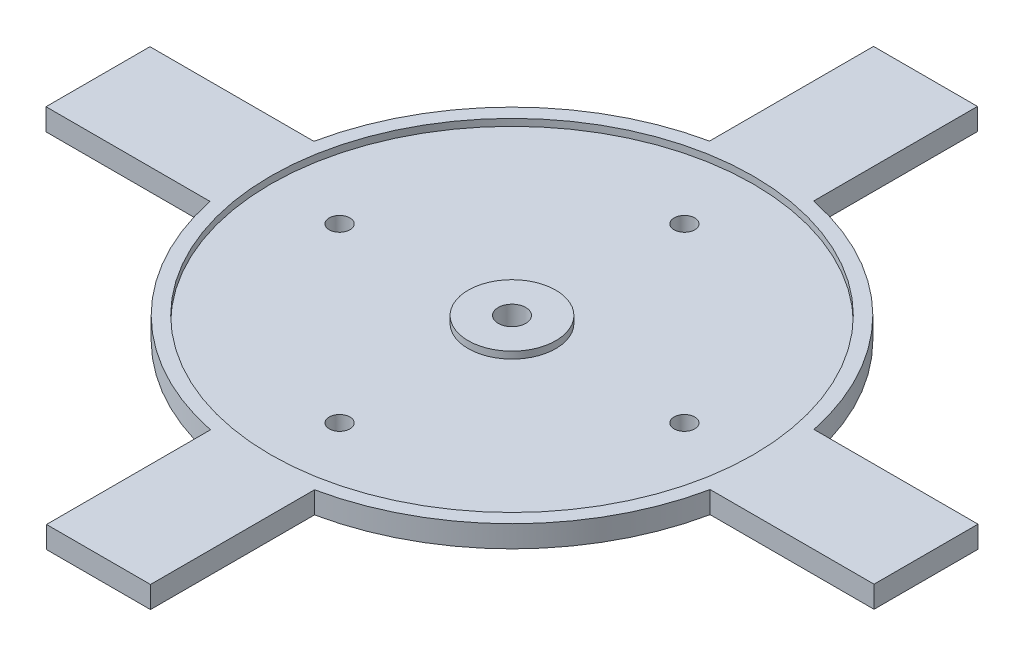
ISO-10303-21;
HEADER;
FILE_DESCRIPTION(('STEP AP214'),'2;1');
FILE_NAME('part.step','',(''),(''),'','','');
FILE_SCHEMA(('AUTOMOTIVE_DESIGN { 1 0 10303 214 1 1 1 1 }'));
ENDSEC;
DATA;
#1=APPLICATION_CONTEXT('core data for automotive mechanical design processes');
#2=APPLICATION_PROTOCOL_DEFINITION('international standard','automotive_design',2000,#1);
#3=PRODUCT_CONTEXT('',#1,'mechanical');
#4=PRODUCT('Part','Part','',(#3));
#5=PRODUCT_RELATED_PRODUCT_CATEGORY('part','',(#4));
#6=PRODUCT_DEFINITION_FORMATION('','',#4);
#7=PRODUCT_DEFINITION_CONTEXT('part definition',#1,'design');
#8=PRODUCT_DEFINITION('design','',#6,#7);
#9=PRODUCT_DEFINITION_SHAPE('','',#8);
#10=(LENGTH_UNIT() NAMED_UNIT(*) SI_UNIT(.MILLI.,.METRE.));
#11=(NAMED_UNIT(*) PLANE_ANGLE_UNIT() SI_UNIT($,.RADIAN.));
#12=(NAMED_UNIT(*) SI_UNIT($,.STERADIAN.) SOLID_ANGLE_UNIT());
#13=UNCERTAINTY_MEASURE_WITH_UNIT(LENGTH_MEASURE(1.E-05),#10,'distance_accuracy_value','');
#14=(GEOMETRIC_REPRESENTATION_CONTEXT(3) GLOBAL_UNCERTAINTY_ASSIGNED_CONTEXT((#13)) GLOBAL_UNIT_ASSIGNED_CONTEXT((#10,
#11,#12)) REPRESENTATION_CONTEXT('',''));
#15=CARTESIAN_POINT('',(0.,0.,0.));
#16=DIRECTION('',(0.,0.,1.));
#17=DIRECTION('',(1.,0.,0.));
#18=AXIS2_PLACEMENT_3D('',#15,#16,#17);
#19=CARTESIAN_POINT('',(0.,3.1581727973184,0.));
#20=DIRECTION('',(0.,-1.,0.));
#21=DIRECTION('',(0.,0.,-1.));
#22=AXIS2_PLACEMENT_3D('',#19,#20,#21);
#23=CYLINDRICAL_SURFACE('',#22,37.);
#24=DIRECTION('',(0.,-1.,0.));
#25=VECTOR('',#24,1.);
#26=CARTESIAN_POINT('',(36.2318920289846,3.1581727973184,7.50000000000038));
#27=LINE('',#26,#25);
#28=CARTESIAN_POINT('',(36.2318920289846,3.1581727973184,7.50000000000038));
#29=VERTEX_POINT('',#28);
#30=CARTESIAN_POINT('',(36.2318920289846,0.,7.50000000000038));
#31=VERTEX_POINT('',#30);
#32=EDGE_CURVE('E298',#29,#31,#27,.T.);
#33=ORIENTED_EDGE('',*,*,#32,.F.);
#34=CARTESIAN_POINT('',(0.,3.1581727973184,0.));
#35=DIRECTION('',(0.,1.,0.));
#36=DIRECTION('',(0.,0.,1.));
#37=AXIS2_PLACEMENT_3D('',#34,#35,#36);
#38=CIRCLE('',#37,37.);
#39=CARTESIAN_POINT('',(7.57567338664189,3.1581727973184,36.2161451943595));
#40=VERTEX_POINT('',#39);
#41=EDGE_CURVE('E12',#40,#29,#38,.T.);
#42=ORIENTED_EDGE('',*,*,#41,.F.);
#43=DIRECTION('',(0.,-1.,0.));
#44=VECTOR('',#43,1.);
#45=CARTESIAN_POINT('',(7.57567338664189,3.1581727973184,36.2161451943595));
#46=LINE('',#45,#44);
#47=CARTESIAN_POINT('',(7.57567338664189,0.,36.2161451943595));
#48=VERTEX_POINT('',#47);
#49=EDGE_CURVE('E323',#40,#48,#46,.T.);
#50=ORIENTED_EDGE('',*,*,#49,.T.);
#51=CARTESIAN_POINT('',(0.,0.,0.));
#52=DIRECTION('',(0.,1.,0.));
#53=DIRECTION('',(0.,0.,1.));
#54=AXIS2_PLACEMENT_3D('',#51,#52,#53);
#55=CIRCLE('',#54,37.);
#56=EDGE_CURVE('E336',#48,#31,#55,.T.);
#57=ORIENTED_EDGE('',*,*,#56,.T.);
#58=EDGE_LOOP('',(#33,#42,#50,#57));
#59=FACE_BOUND('',#58,.T.);
#60=ADVANCED_FACE('F92',(#59),#23,.T.);
#61=CARTESIAN_POINT('',(36.2161451943595,3.1581727973184,-7.57567338664151));
#62=VERTEX_POINT('',#61);
#63=CARTESIAN_POINT('',(7.5,3.1581727973184,-36.2318920289846));
#64=VERTEX_POINT('',#63);
#65=EDGE_CURVE('E101',#62,#64,#38,.T.);
#66=ORIENTED_EDGE('',*,*,#65,.F.);
#67=DIRECTION('',(0.,-1.,0.));
#68=VECTOR('',#67,1.);
#69=CARTESIAN_POINT('',(36.2161451943595,3.1581727973184,-7.57567338664151));
#70=LINE('',#69,#68);
#71=CARTESIAN_POINT('',(36.2161451943595,0.,-7.57567338664151));
#72=VERTEX_POINT('',#71);
#73=EDGE_CURVE('E228',#62,#72,#70,.T.);
#74=ORIENTED_EDGE('',*,*,#73,.T.);
#75=CARTESIAN_POINT('',(7.5,0.,-36.2318920289846));
#76=VERTEX_POINT('',#75);
#77=EDGE_CURVE('E338',#72,#76,#55,.T.);
#78=ORIENTED_EDGE('',*,*,#77,.T.);
#79=DIRECTION('',(0.,-1.,0.));
#80=VECTOR('',#79,1.);
#81=CARTESIAN_POINT('',(7.5,3.1581727973184,-36.2318920289846));
#82=LINE('',#81,#80);
#83=EDGE_CURVE('E295',#64,#76,#82,.T.);
#84=ORIENTED_EDGE('',*,*,#83,.F.);
#85=EDGE_LOOP('',(#66,#74,#78,#84));
#86=FACE_BOUND('',#85,.T.);
#87=ADVANCED_FACE('F395',(#86),#23,.T.);
#88=CARTESIAN_POINT('',(-7.57567338664189,3.1581727973184,-36.2161451943595));
#89=VERTEX_POINT('',#88);
#90=CARTESIAN_POINT('',(-36.2318920289846,3.1581727973184,-7.50000000000013));
#91=VERTEX_POINT('',#90);
#92=EDGE_CURVE('E411',#89,#91,#38,.T.);
#93=ORIENTED_EDGE('',*,*,#92,.F.);
#94=DIRECTION('',(0.,-1.,0.));
#95=VECTOR('',#94,1.);
#96=CARTESIAN_POINT('',(-7.57567338664189,3.1581727973184,-36.2161451943595));
#97=LINE('',#96,#95);
#98=CARTESIAN_POINT('',(-7.57567338664189,0.,-36.2161451943595));
#99=VERTEX_POINT('',#98);
#100=EDGE_CURVE('E304',#89,#99,#97,.T.);
#101=ORIENTED_EDGE('',*,*,#100,.T.);
#102=CARTESIAN_POINT('',(-36.2318920289846,0.,-7.50000000000013));
#103=VERTEX_POINT('',#102);
#104=EDGE_CURVE('E424',#99,#103,#55,.T.);
#105=ORIENTED_EDGE('',*,*,#104,.T.);
#106=DIRECTION('',(0.,-1.,0.));
#107=VECTOR('',#106,1.);
#108=CARTESIAN_POINT('',(-36.2318920289846,3.1581727973184,-7.50000000000013));
#109=LINE('',#108,#107);
#110=EDGE_CURVE('E117',#91,#103,#109,.T.);
#111=ORIENTED_EDGE('',*,*,#110,.F.);
#112=EDGE_LOOP('',(#93,#101,#105,#111));
#113=FACE_BOUND('',#112,.T.);
#114=ADVANCED_FACE('F400',(#113),#23,.T.);
#115=CARTESIAN_POINT('',(-36.2161451943595,3.1581727973184,7.57567338664176));
#116=VERTEX_POINT('',#115);
#117=CARTESIAN_POINT('',(-7.5,3.1581727973184,36.2318920289846));
#118=VERTEX_POINT('',#117);
#119=EDGE_CURVE('E103',#116,#118,#38,.T.);
#120=ORIENTED_EDGE('',*,*,#119,.F.);
#121=DIRECTION('',(0.,-1.,0.));
#122=VECTOR('',#121,1.);
#123=CARTESIAN_POINT('',(-36.2161451943595,3.1581727973184,7.57567338664176));
#124=LINE('',#123,#122);
#125=CARTESIAN_POINT('',(-36.2161451943595,0.,7.57567338664176));
#126=VERTEX_POINT('',#125);
#127=EDGE_CURVE('E302',#116,#126,#124,.T.);
#128=ORIENTED_EDGE('',*,*,#127,.T.);
#129=CARTESIAN_POINT('',(-7.5,0.,36.2318920289846));
#130=VERTEX_POINT('',#129);
#131=EDGE_CURVE('E334',#126,#130,#55,.T.);
#132=ORIENTED_EDGE('',*,*,#131,.T.);
#133=DIRECTION('',(0.,-1.,0.));
#134=VECTOR('',#133,1.);
#135=CARTESIAN_POINT('',(-7.5,3.1581727973184,36.2318920289846));
#136=LINE('',#135,#134);
#137=EDGE_CURVE('E332',#118,#130,#136,.T.);
#138=ORIENTED_EDGE('',*,*,#137,.F.);
#139=EDGE_LOOP('',(#120,#128,#132,#138));
#140=FACE_BOUND('',#139,.T.);
#141=ADVANCED_FACE('F94',(#140),#23,.T.);
#142=CARTESIAN_POINT('',(0.,3.1581727973184,0.));
#143=DIRECTION('',(0.,1.,0.));
#144=DIRECTION('',(0.,0.,1.));
#145=AXIS2_PLACEMENT_3D('',#142,#143,#144);
#146=PLANE('',#145);
#147=CARTESIAN_POINT('',(0.,3.1581727973184,0.));
#148=DIRECTION('',(0.,1.,0.));
#149=DIRECTION('',(0.,0.,1.));
#150=AXIS2_PLACEMENT_3D('',#147,#148,#149);
#151=CIRCLE('',#150,35.);
#152=CARTESIAN_POINT('',(0.,3.1581727973184,35.));
#153=VERTEX_POINT('',#152);
#154=EDGE_CURVE('E237',#153,#153,#151,.T.);
#155=ORIENTED_EDGE('',*,*,#154,.F.);
#156=EDGE_LOOP('',(#155));
#157=FACE_BOUND('',#156,.T.);
#158=ORIENTED_EDGE('',*,*,#65,.T.);
#159=DIRECTION('',(0.,0.,1.));
#160=VECTOR('',#159,1.);
#161=CARTESIAN_POINT('',(7.5,3.1581727973184,-60.));
#162=LINE('',#161,#160);
#163=CARTESIAN_POINT('',(7.5,3.1581727973184,-60.));
#164=VERTEX_POINT('',#163);
#165=EDGE_CURVE('E268',#164,#64,#162,.T.);
#166=ORIENTED_EDGE('',*,*,#165,.F.);
#167=DIRECTION('',(1.,0.,0.));
#168=VECTOR('',#167,1.);
#169=CARTESIAN_POINT('',(0.,3.1581727973184,-60.));
#170=LINE('',#169,#168);
#171=CARTESIAN_POINT('',(-7.57567338664189,3.1581727973184,-60.));
#172=VERTEX_POINT('',#171);
#173=EDGE_CURVE('E255',#172,#164,#170,.T.);
#174=ORIENTED_EDGE('',*,*,#173,.F.);
#175=DIRECTION('',(0.,0.,1.));
#176=VECTOR('',#175,1.);
#177=CARTESIAN_POINT('',(-7.57567338664189,3.1581727973184,-60.));
#178=LINE('',#177,#176);
#179=EDGE_CURVE('E251',#172,#89,#178,.T.);
#180=ORIENTED_EDGE('',*,*,#179,.T.);
#181=ORIENTED_EDGE('',*,*,#92,.T.);
#182=DIRECTION('',(1.,0.,0.));
#183=VECTOR('',#182,1.);
#184=CARTESIAN_POINT('',(-60.,3.1581727973184,-7.50000000000021));
#185=LINE('',#184,#183);
#186=CARTESIAN_POINT('',(-60.,3.1581727973184,-7.50000000000021));
#187=VERTEX_POINT('',#186);
#188=EDGE_CURVE('E291',#187,#91,#185,.T.);
#189=ORIENTED_EDGE('',*,*,#188,.F.);
#190=DIRECTION('',(0.,0.,-1.));
#191=VECTOR('',#190,1.);
#192=CARTESIAN_POINT('',(-60.,3.1581727973184,-2.09488880330588E-13));
#193=LINE('',#192,#191);
#194=CARTESIAN_POINT('',(-60.,3.1581727973184,7.57567338664168));
#195=VERTEX_POINT('',#194);
#196=EDGE_CURVE('E278',#195,#187,#193,.T.);
#197=ORIENTED_EDGE('',*,*,#196,.F.);
#198=DIRECTION('',(1.,0.,0.));
#199=VECTOR('',#198,1.);
#200=CARTESIAN_POINT('',(-60.,3.1581727973184,7.57567338664168));
#201=LINE('',#200,#199);
#202=EDGE_CURVE('E274',#195,#116,#201,.T.);
#203=ORIENTED_EDGE('',*,*,#202,.T.);
#204=ORIENTED_EDGE('',*,*,#119,.T.);
#205=DIRECTION('',(0.,0.,-1.));
#206=VECTOR('',#205,1.);
#207=CARTESIAN_POINT('',(-7.5,3.1581727973184,60.));
#208=LINE('',#207,#206);
#209=CARTESIAN_POINT('',(-7.5,3.1581727973184,60.));
#210=VERTEX_POINT('',#209);
#211=EDGE_CURVE('E320',#210,#118,#208,.T.);
#212=ORIENTED_EDGE('',*,*,#211,.F.);
#213=DIRECTION('',(-1.,0.,0.));
#214=VECTOR('',#213,1.);
#215=CARTESIAN_POINT('',(0.,3.1581727973184,60.));
#216=LINE('',#215,#214);
#217=CARTESIAN_POINT('',(7.57567338664189,3.1581727973184,60.));
#218=VERTEX_POINT('',#217);
#219=EDGE_CURVE('E308',#218,#210,#216,.T.);
#220=ORIENTED_EDGE('',*,*,#219,.F.);
#221=DIRECTION('',(0.,0.,-1.));
#222=VECTOR('',#221,1.);
#223=CARTESIAN_POINT('',(7.57567338664189,3.1581727973184,60.));
#224=LINE('',#223,#222);
#225=EDGE_CURVE('E326',#218,#40,#224,.T.);
#226=ORIENTED_EDGE('',*,*,#225,.T.);
#227=ORIENTED_EDGE('',*,*,#41,.T.);
#228=DIRECTION('',(-1.,0.,0.));
#229=VECTOR('',#228,1.);
#230=CARTESIAN_POINT('',(59.9999999999999,3.1581727973184,7.50000000000063));
#231=LINE('',#230,#229);
#232=CARTESIAN_POINT('',(59.9999999999999,3.1581727973184,7.50000000000063));
#233=VERTEX_POINT('',#232);
#234=EDGE_CURVE('E215',#233,#29,#231,.T.);
#235=ORIENTED_EDGE('',*,*,#234,.F.);
#236=DIRECTION('',(0.,0.,1.));
#237=VECTOR('',#236,1.);
#238=CARTESIAN_POINT('',(60.,3.1581727973184,6.28466640991764E-13));
#239=LINE('',#238,#237);
#240=CARTESIAN_POINT('',(60.0000000000001,3.1581727973184,-7.57567338664126));
#241=VERTEX_POINT('',#240);
#242=EDGE_CURVE('E209',#241,#233,#239,.T.);
#243=ORIENTED_EDGE('',*,*,#242,.F.);
#244=DIRECTION('',(-1.,0.,0.));
#245=VECTOR('',#244,1.);
#246=CARTESIAN_POINT('',(60.0000000000001,3.1581727973184,-7.57567338664126));
#247=LINE('',#246,#245);
#248=EDGE_CURVE('E213',#241,#62,#247,.T.);
#249=ORIENTED_EDGE('',*,*,#248,.T.);
#250=EDGE_LOOP('',(#158,#166,#174,#180,#181,#189,#197,#203,#204,#212,#220,#226,#227,#235,#243,#249));
#251=FACE_BOUND('',#250,.T.);
#252=ADVANCED_FACE('F212',(#157,#251),#146,.T.);
#253=CARTESIAN_POINT('',(0.,0.,0.));
#254=DIRECTION('',(0.,1.,0.));
#255=DIRECTION('',(0.,0.,1.));
#256=AXIS2_PLACEMENT_3D('',#253,#254,#255);
#257=PLANE('',#256);
#258=CARTESIAN_POINT('',(25.,0.,0.));
#259=DIRECTION('',(0.,1.,0.));
#260=DIRECTION('',(0.,0.,1.));
#261=AXIS2_PLACEMENT_3D('',#258,#259,#260);
#262=CIRCLE('',#261,1.5);
#263=CARTESIAN_POINT('',(25.,0.,1.50000000000009));
#264=VERTEX_POINT('',#263);
#265=EDGE_CURVE('E343',#264,#264,#262,.T.);
#266=ORIENTED_EDGE('',*,*,#265,.T.);
#267=EDGE_LOOP('',(#266));
#268=FACE_BOUND('',#267,.T.);
#269=CARTESIAN_POINT('',(0.,0.,25.));
#270=DIRECTION('',(0.,1.,0.));
#271=DIRECTION('',(0.,0.,1.));
#272=AXIS2_PLACEMENT_3D('',#269,#270,#271);
#273=CIRCLE('',#272,1.5);
#274=CARTESIAN_POINT('',(0.,0.,26.5));
#275=VERTEX_POINT('',#274);
#276=EDGE_CURVE('E349',#275,#275,#273,.T.);
#277=ORIENTED_EDGE('',*,*,#276,.T.);
#278=EDGE_LOOP('',(#277));
#279=FACE_BOUND('',#278,.T.);
#280=CARTESIAN_POINT('',(-25.,0.,-2.61861100413235E-13));
#281=DIRECTION('',(0.,1.,0.));
#282=DIRECTION('',(0.,0.,1.));
#283=AXIS2_PLACEMENT_3D('',#280,#281,#282);
#284=CIRCLE('',#283,1.5);
#285=CARTESIAN_POINT('',(-25.,0.,1.49999999999974));
#286=VERTEX_POINT('',#285);
#287=EDGE_CURVE('E346',#286,#286,#284,.T.);
#288=ORIENTED_EDGE('',*,*,#287,.T.);
#289=EDGE_LOOP('',(#288));
#290=FACE_BOUND('',#289,.T.);
#291=CARTESIAN_POINT('',(0.,0.,-25.));
#292=DIRECTION('',(0.,1.,0.));
#293=DIRECTION('',(0.,0.,1.));
#294=AXIS2_PLACEMENT_3D('',#291,#292,#293);
#295=CIRCLE('',#294,1.5);
#296=CARTESIAN_POINT('',(0.,0.,-23.5));
#297=VERTEX_POINT('',#296);
#298=EDGE_CURVE('E342',#297,#297,#295,.T.);
#299=ORIENTED_EDGE('',*,*,#298,.T.);
#300=EDGE_LOOP('',(#299));
#301=FACE_BOUND('',#300,.T.);
#302=CARTESIAN_POINT('',(0.,0.,0.));
#303=DIRECTION('',(0.,1.,0.));
#304=DIRECTION('',(0.,0.,1.));
#305=AXIS2_PLACEMENT_3D('',#302,#303,#304);
#306=CIRCLE('',#305,2.);
#307=CARTESIAN_POINT('',(0.,0.,2.));
#308=VERTEX_POINT('',#307);
#309=EDGE_CURVE('E366',#308,#308,#306,.T.);
#310=ORIENTED_EDGE('',*,*,#309,.T.);
#311=EDGE_LOOP('',(#310));
#312=FACE_BOUND('',#311,.T.);
#313=ORIENTED_EDGE('',*,*,#104,.F.);
#314=DIRECTION('',(0.,0.,1.));
#315=VECTOR('',#314,1.);
#316=CARTESIAN_POINT('',(-7.57567338664189,0.,-60.));
#317=LINE('',#316,#315);
#318=CARTESIAN_POINT('',(-7.57567338664189,0.,-60.));
#319=VERTEX_POINT('',#318);
#320=EDGE_CURVE('E252',#319,#99,#317,.T.);
#321=ORIENTED_EDGE('',*,*,#320,.F.);
#322=DIRECTION('',(1.,0.,0.));
#323=VECTOR('',#322,1.);
#324=CARTESIAN_POINT('',(0.,0.,-60.));
#325=LINE('',#324,#323);
#326=CARTESIAN_POINT('',(7.5,0.,-60.));
#327=VERTEX_POINT('',#326);
#328=EDGE_CURVE('E262',#319,#327,#325,.T.);
#329=ORIENTED_EDGE('',*,*,#328,.T.);
#330=DIRECTION('',(0.,0.,1.));
#331=VECTOR('',#330,1.);
#332=CARTESIAN_POINT('',(7.5,0.,-60.));
#333=LINE('',#332,#331);
#334=EDGE_CURVE('E265',#327,#76,#333,.T.);
#335=ORIENTED_EDGE('',*,*,#334,.T.);
#336=ORIENTED_EDGE('',*,*,#77,.F.);
#337=DIRECTION('',(-1.,0.,0.));
#338=VECTOR('',#337,1.);
#339=CARTESIAN_POINT('',(60.0000000000001,0.,-7.57567338664126));
#340=LINE('',#339,#338);
#341=CARTESIAN_POINT('',(60.0000000000001,0.,-7.57567338664126));
#342=VERTEX_POINT('',#341);
#343=EDGE_CURVE('E219',#342,#72,#340,.T.);
#344=ORIENTED_EDGE('',*,*,#343,.F.);
#345=DIRECTION('',(0.,0.,1.));
#346=VECTOR('',#345,1.);
#347=CARTESIAN_POINT('',(60.,0.,6.28466640991764E-13));
#348=LINE('',#347,#346);
#349=CARTESIAN_POINT('',(59.9999999999999,0.,7.50000000000063));
#350=VERTEX_POINT('',#349);
#351=EDGE_CURVE('E232',#342,#350,#348,.T.);
#352=ORIENTED_EDGE('',*,*,#351,.T.);
#353=DIRECTION('',(-1.,0.,0.));
#354=VECTOR('',#353,1.);
#355=CARTESIAN_POINT('',(59.9999999999999,0.,7.50000000000063));
#356=LINE('',#355,#354);
#357=EDGE_CURVE('E244',#350,#31,#356,.T.);
#358=ORIENTED_EDGE('',*,*,#357,.T.);
#359=ORIENTED_EDGE('',*,*,#56,.F.);
#360=DIRECTION('',(0.,0.,-1.));
#361=VECTOR('',#360,1.);
#362=CARTESIAN_POINT('',(7.57567338664189,0.,60.));
#363=LINE('',#362,#361);
#364=CARTESIAN_POINT('',(7.57567338664189,0.,60.));
#365=VERTEX_POINT('',#364);
#366=EDGE_CURVE('E312',#365,#48,#363,.T.);
#367=ORIENTED_EDGE('',*,*,#366,.F.);
#368=DIRECTION('',(-1.,0.,0.));
#369=VECTOR('',#368,1.);
#370=CARTESIAN_POINT('',(0.,0.,60.));
#371=LINE('',#370,#369);
#372=CARTESIAN_POINT('',(-7.5,0.,60.));
#373=VERTEX_POINT('',#372);
#374=EDGE_CURVE('E314',#365,#373,#371,.T.);
#375=ORIENTED_EDGE('',*,*,#374,.T.);
#376=DIRECTION('',(0.,0.,-1.));
#377=VECTOR('',#376,1.);
#378=CARTESIAN_POINT('',(-7.5,0.,60.));
#379=LINE('',#378,#377);
#380=EDGE_CURVE('E317',#373,#130,#379,.T.);
#381=ORIENTED_EDGE('',*,*,#380,.T.);
#382=ORIENTED_EDGE('',*,*,#131,.F.);
#383=DIRECTION('',(1.,0.,0.));
#384=VECTOR('',#383,1.);
#385=CARTESIAN_POINT('',(-60.,0.,7.57567338664168));
#386=LINE('',#385,#384);
#387=CARTESIAN_POINT('',(-60.,0.,7.57567338664168));
#388=VERTEX_POINT('',#387);
#389=EDGE_CURVE('E275',#388,#126,#386,.T.);
#390=ORIENTED_EDGE('',*,*,#389,.F.);
#391=DIRECTION('',(0.,0.,-1.));
#392=VECTOR('',#391,1.);
#393=CARTESIAN_POINT('',(-60.,0.,-2.09488880330588E-13));
#394=LINE('',#393,#392);
#395=CARTESIAN_POINT('',(-60.,0.,-7.50000000000021));
#396=VERTEX_POINT('',#395);
#397=EDGE_CURVE('E285',#388,#396,#394,.T.);
#398=ORIENTED_EDGE('',*,*,#397,.T.);
#399=DIRECTION('',(1.,0.,0.));
#400=VECTOR('',#399,1.);
#401=CARTESIAN_POINT('',(-60.,0.,-7.50000000000021));
#402=LINE('',#401,#400);
#403=EDGE_CURVE('E288',#396,#103,#402,.T.);
#404=ORIENTED_EDGE('',*,*,#403,.T.);
#405=EDGE_LOOP('',(#313,#321,#329,#335,#336,#344,#352,#358,#359,#367,#375,#381,#382,#390,#398,#404));
#406=FACE_BOUND('',#405,.T.);
#407=ADVANCED_FACE('F407',(#268,#279,#290,#301,#312,#406),#257,.F.);
#408=CARTESIAN_POINT('',(-7.5,3.1581727973184,60.));
#409=DIRECTION('',(1.,0.,0.));
#410=DIRECTION('',(0.,0.,-1.));
#411=AXIS2_PLACEMENT_3D('',#408,#409,#410);
#412=PLANE('',#411);
#413=ORIENTED_EDGE('',*,*,#211,.T.);
#414=ORIENTED_EDGE('',*,*,#137,.T.);
#415=ORIENTED_EDGE('',*,*,#380,.F.);
#416=DIRECTION('',(0.,-1.,0.));
#417=VECTOR('',#416,1.);
#418=CARTESIAN_POINT('',(-7.5,3.1581727973184,60.));
#419=LINE('',#418,#417);
#420=EDGE_CURVE('E311',#210,#373,#419,.T.);
#421=ORIENTED_EDGE('',*,*,#420,.F.);
#422=EDGE_LOOP('',(#413,#414,#415,#421));
#423=FACE_BOUND('',#422,.T.);
#424=ADVANCED_FACE('F429',(#423),#412,.F.);
#425=CARTESIAN_POINT('',(7.57567338664189,3.1581727973184,60.));
#426=DIRECTION('',(1.,0.,0.));
#427=DIRECTION('',(0.,0.,-1.));
#428=AXIS2_PLACEMENT_3D('',#425,#426,#427);
#429=PLANE('',#428);
#430=ORIENTED_EDGE('',*,*,#49,.F.);
#431=ORIENTED_EDGE('',*,*,#225,.F.);
#432=DIRECTION('',(0.,-1.,0.));
#433=VECTOR('',#432,1.);
#434=CARTESIAN_POINT('',(7.57567338664189,3.1581727973184,60.));
#435=LINE('',#434,#433);
#436=EDGE_CURVE('E307',#218,#365,#435,.T.);
#437=ORIENTED_EDGE('',*,*,#436,.T.);
#438=ORIENTED_EDGE('',*,*,#366,.T.);
#439=EDGE_LOOP('',(#430,#431,#437,#438));
#440=FACE_BOUND('',#439,.T.);
#441=ADVANCED_FACE('F456',(#440),#429,.T.);
#442=CARTESIAN_POINT('',(0.,0.,60.));
#443=DIRECTION('',(0.,0.,1.));
#444=DIRECTION('',(1.,0.,0.));
#445=AXIS2_PLACEMENT_3D('',#442,#443,#444);
#446=PLANE('',#445);
#447=ORIENTED_EDGE('',*,*,#219,.T.);
#448=ORIENTED_EDGE('',*,*,#420,.T.);
#449=ORIENTED_EDGE('',*,*,#374,.F.);
#450=ORIENTED_EDGE('',*,*,#436,.F.);
#451=EDGE_LOOP('',(#447,#448,#449,#450));
#452=FACE_BOUND('',#451,.T.);
#453=ADVANCED_FACE('F435',(#452),#446,.T.);
#454=CARTESIAN_POINT('',(0.,0.,-60.));
#455=DIRECTION('',(0.,0.,-1.));
#456=DIRECTION('',(-1.,0.,0.));
#457=AXIS2_PLACEMENT_3D('',#454,#455,#456);
#458=PLANE('',#457);
#459=ORIENTED_EDGE('',*,*,#173,.T.);
#460=DIRECTION('',(0.,-1.,0.));
#461=VECTOR('',#460,1.);
#462=CARTESIAN_POINT('',(7.5,3.1581727973184,-60.));
#463=LINE('',#462,#461);
#464=EDGE_CURVE('E260',#164,#327,#463,.T.);
#465=ORIENTED_EDGE('',*,*,#464,.T.);
#466=ORIENTED_EDGE('',*,*,#328,.F.);
#467=DIRECTION('',(0.,-1.,0.));
#468=VECTOR('',#467,1.);
#469=CARTESIAN_POINT('',(-7.57567338664189,3.1581727973184,-60.));
#470=LINE('',#469,#468);
#471=EDGE_CURVE('E248',#172,#319,#470,.T.);
#472=ORIENTED_EDGE('',*,*,#471,.F.);
#473=EDGE_LOOP('',(#459,#465,#466,#472));
#474=FACE_BOUND('',#473,.T.);
#475=ADVANCED_FACE('F421',(#474),#458,.T.);
#476=CARTESIAN_POINT('',(7.5,3.1581727973184,-60.));
#477=DIRECTION('',(-1.,0.,0.));
#478=DIRECTION('',(0.,0.,1.));
#479=AXIS2_PLACEMENT_3D('',#476,#477,#478);
#480=PLANE('',#479);
#481=ORIENTED_EDGE('',*,*,#165,.T.);
#482=ORIENTED_EDGE('',*,*,#83,.T.);
#483=ORIENTED_EDGE('',*,*,#334,.F.);
#484=ORIENTED_EDGE('',*,*,#464,.F.);
#485=EDGE_LOOP('',(#481,#482,#483,#484));
#486=FACE_BOUND('',#485,.T.);
#487=ADVANCED_FACE('F525',(#486),#480,.F.);
#488=CARTESIAN_POINT('',(-7.57567338664189,3.1581727973184,-60.));
#489=DIRECTION('',(-1.,0.,0.));
#490=DIRECTION('',(0.,0.,1.));
#491=AXIS2_PLACEMENT_3D('',#488,#489,#490);
#492=PLANE('',#491);
#493=ORIENTED_EDGE('',*,*,#100,.F.);
#494=ORIENTED_EDGE('',*,*,#179,.F.);
#495=ORIENTED_EDGE('',*,*,#471,.T.);
#496=ORIENTED_EDGE('',*,*,#320,.T.);
#497=EDGE_LOOP('',(#493,#494,#495,#496));
#498=FACE_BOUND('',#497,.T.);
#499=ADVANCED_FACE('F416',(#498),#492,.T.);
#500=CARTESIAN_POINT('',(-60.,0.,-2.09488880330588E-13));
#501=DIRECTION('',(-1.,0.,0.));
#502=DIRECTION('',(0.,0.,1.));
#503=AXIS2_PLACEMENT_3D('',#500,#501,#502);
#504=PLANE('',#503);
#505=ORIENTED_EDGE('',*,*,#196,.T.);
#506=DIRECTION('',(0.,-1.,0.));
#507=VECTOR('',#506,1.);
#508=CARTESIAN_POINT('',(-60.,3.1581727973184,-7.50000000000021));
#509=LINE('',#508,#507);
#510=EDGE_CURVE('E283',#187,#396,#509,.T.);
#511=ORIENTED_EDGE('',*,*,#510,.T.);
#512=ORIENTED_EDGE('',*,*,#397,.F.);
#513=DIRECTION('',(0.,-1.,0.));
#514=VECTOR('',#513,1.);
#515=CARTESIAN_POINT('',(-60.,3.1581727973184,7.57567338664168));
#516=LINE('',#515,#514);
#517=EDGE_CURVE('E271',#195,#388,#516,.T.);
#518=ORIENTED_EDGE('',*,*,#517,.F.);
#519=EDGE_LOOP('',(#505,#511,#512,#518));
#520=FACE_BOUND('',#519,.T.);
#521=ADVANCED_FACE('F442',(#520),#504,.T.);
#522=CARTESIAN_POINT('',(-60.,3.1581727973184,-7.50000000000021));
#523=DIRECTION('',(0.,0.,1.));
#524=DIRECTION('',(1.,0.,0.));
#525=AXIS2_PLACEMENT_3D('',#522,#523,#524);
#526=PLANE('',#525);
#527=ORIENTED_EDGE('',*,*,#188,.T.);
#528=ORIENTED_EDGE('',*,*,#110,.T.);
#529=ORIENTED_EDGE('',*,*,#403,.F.);
#530=ORIENTED_EDGE('',*,*,#510,.F.);
#531=EDGE_LOOP('',(#527,#528,#529,#530));
#532=FACE_BOUND('',#531,.T.);
#533=ADVANCED_FACE('F444',(#532),#526,.F.);
#534=CARTESIAN_POINT('',(-60.,3.1581727973184,7.57567338664168));
#535=DIRECTION('',(0.,0.,1.));
#536=DIRECTION('',(1.,0.,0.));
#537=AXIS2_PLACEMENT_3D('',#534,#535,#536);
#538=PLANE('',#537);
#539=ORIENTED_EDGE('',*,*,#127,.F.);
#540=ORIENTED_EDGE('',*,*,#202,.F.);
#541=ORIENTED_EDGE('',*,*,#517,.T.);
#542=ORIENTED_EDGE('',*,*,#389,.T.);
#543=EDGE_LOOP('',(#539,#540,#541,#542));
#544=FACE_BOUND('',#543,.T.);
#545=ADVANCED_FACE('F440',(#544),#538,.T.);
#546=CARTESIAN_POINT('',(60.0000000000001,3.1581727973184,-7.57567338664126));
#547=DIRECTION('',(0.,0.,-1.));
#548=DIRECTION('',(-1.,0.,0.));
#549=AXIS2_PLACEMENT_3D('',#546,#547,#548);
#550=PLANE('',#549);
#551=ORIENTED_EDGE('',*,*,#73,.F.);
#552=ORIENTED_EDGE('',*,*,#248,.F.);
#553=DIRECTION('',(0.,-1.,0.));
#554=VECTOR('',#553,1.);
#555=CARTESIAN_POINT('',(60.0000000000001,3.1581727973184,-7.57567338664126));
#556=LINE('',#555,#554);
#557=EDGE_CURVE('E226',#241,#342,#556,.T.);
#558=ORIENTED_EDGE('',*,*,#557,.T.);
#559=ORIENTED_EDGE('',*,*,#343,.T.);
#560=EDGE_LOOP('',(#551,#552,#558,#559));
#561=FACE_BOUND('',#560,.T.);
#562=ADVANCED_FACE('F224',(#561),#550,.T.);
#563=CARTESIAN_POINT('',(59.9999999999999,3.1581727973184,7.50000000000063));
#564=DIRECTION('',(0.,0.,-1.));
#565=DIRECTION('',(-1.,0.,0.));
#566=AXIS2_PLACEMENT_3D('',#563,#564,#565);
#567=PLANE('',#566);
#568=ORIENTED_EDGE('',*,*,#234,.T.);
#569=ORIENTED_EDGE('',*,*,#32,.T.);
#570=ORIENTED_EDGE('',*,*,#357,.F.);
#571=DIRECTION('',(0.,-1.,0.));
#572=VECTOR('',#571,1.);
#573=CARTESIAN_POINT('',(59.9999999999999,3.1581727973184,7.50000000000063));
#574=LINE('',#573,#572);
#575=EDGE_CURVE('E218',#233,#350,#574,.T.);
#576=ORIENTED_EDGE('',*,*,#575,.F.);
#577=EDGE_LOOP('',(#568,#569,#570,#576));
#578=FACE_BOUND('',#577,.T.);
#579=ADVANCED_FACE('F515',(#578),#567,.F.);
#580=CARTESIAN_POINT('',(60.,0.,6.28466640991764E-13));
#581=DIRECTION('',(1.,0.,0.));
#582=DIRECTION('',(0.,0.,-1.));
#583=AXIS2_PLACEMENT_3D('',#580,#581,#582);
#584=PLANE('',#583);
#585=ORIENTED_EDGE('',*,*,#242,.T.);
#586=ORIENTED_EDGE('',*,*,#575,.T.);
#587=ORIENTED_EDGE('',*,*,#351,.F.);
#588=ORIENTED_EDGE('',*,*,#557,.F.);
#589=EDGE_LOOP('',(#585,#586,#587,#588));
#590=FACE_BOUND('',#589,.T.);
#591=ADVANCED_FACE('F230',(#590),#584,.T.);
#592=CARTESIAN_POINT('',(0.,2.1581727973184,0.));
#593=DIRECTION('',(0.,1.,0.));
#594=DIRECTION('',(0.,0.,1.));
#595=AXIS2_PLACEMENT_3D('',#592,#593,#594);
#596=CYLINDRICAL_SURFACE('',#595,35.);
#597=CARTESIAN_POINT('',(0.,2.1581727973184,0.));
#598=DIRECTION('',(0.,1.,0.));
#599=DIRECTION('',(0.,0.,1.));
#600=AXIS2_PLACEMENT_3D('',#597,#598,#599);
#601=CIRCLE('',#600,35.);
#602=CARTESIAN_POINT('',(0.,2.1581727973184,35.));
#603=VERTEX_POINT('',#602);
#604=EDGE_CURVE('E234',#603,#603,#601,.T.);
#605=ORIENTED_EDGE('',*,*,#604,.F.);
#606=EDGE_LOOP('',(#605));
#607=FACE_BOUND('',#606,.T.);
#608=ORIENTED_EDGE('',*,*,#154,.T.);
#609=EDGE_LOOP('',(#608));
#610=FACE_BOUND('',#609,.T.);
#611=ADVANCED_FACE('F390',(#607,#610),#596,.F.);
#612=CARTESIAN_POINT('',(0.,2.1581727973184,0.));
#613=DIRECTION('',(0.,1.,0.));
#614=DIRECTION('',(0.,0.,1.));
#615=AXIS2_PLACEMENT_3D('',#612,#613,#614);
#616=PLANE('',#615);
#617=CARTESIAN_POINT('',(25.,2.1581727973184,0.));
#618=DIRECTION('',(0.,1.,0.));
#619=DIRECTION('',(0.,0.,1.));
#620=AXIS2_PLACEMENT_3D('',#617,#618,#619);
#621=CIRCLE('',#620,1.5);
#622=CARTESIAN_POINT('',(25.,2.1581727973184,1.50000000000009));
#623=VERTEX_POINT('',#622);
#624=EDGE_CURVE('E96',#623,#623,#621,.T.);
#625=ORIENTED_EDGE('',*,*,#624,.F.);
#626=EDGE_LOOP('',(#625));
#627=FACE_BOUND('',#626,.T.);
#628=CARTESIAN_POINT('',(0.,2.1581727973184,25.));
#629=DIRECTION('',(0.,1.,0.));
#630=DIRECTION('',(0.,0.,1.));
#631=AXIS2_PLACEMENT_3D('',#628,#629,#630);
#632=CIRCLE('',#631,1.5);
#633=CARTESIAN_POINT('',(0.,2.1581727973184,26.5));
#634=VERTEX_POINT('',#633);
#635=EDGE_CURVE('E347',#634,#634,#632,.T.);
#636=ORIENTED_EDGE('',*,*,#635,.F.);
#637=EDGE_LOOP('',(#636));
#638=FACE_BOUND('',#637,.T.);
#639=CARTESIAN_POINT('',(-25.,2.1581727973184,-2.61861100413235E-13));
#640=DIRECTION('',(0.,1.,0.));
#641=DIRECTION('',(0.,0.,1.));
#642=AXIS2_PLACEMENT_3D('',#639,#640,#641);
#643=CIRCLE('',#642,1.5);
#644=CARTESIAN_POINT('',(-25.,2.1581727973184,1.49999999999974));
#645=VERTEX_POINT('',#644);
#646=EDGE_CURVE('E344',#645,#645,#643,.T.);
#647=ORIENTED_EDGE('',*,*,#646,.F.);
#648=EDGE_LOOP('',(#647));
#649=FACE_BOUND('',#648,.T.);
#650=CARTESIAN_POINT('',(0.,2.1581727973184,-25.));
#651=DIRECTION('',(0.,1.,0.));
#652=DIRECTION('',(0.,0.,1.));
#653=AXIS2_PLACEMENT_3D('',#650,#651,#652);
#654=CIRCLE('',#653,1.5);
#655=CARTESIAN_POINT('',(0.,2.1581727973184,-23.5));
#656=VERTEX_POINT('',#655);
#657=EDGE_CURVE('E339',#656,#656,#654,.T.);
#658=ORIENTED_EDGE('',*,*,#657,.F.);
#659=EDGE_LOOP('',(#658));
#660=FACE_BOUND('',#659,.T.);
#661=CARTESIAN_POINT('',(0.,2.1581727973184,0.));
#662=DIRECTION('',(0.,1.,0.));
#663=DIRECTION('',(0.,0.,1.));
#664=AXIS2_PLACEMENT_3D('',#661,#662,#663);
#665=CIRCLE('',#664,6.35);
#666=CARTESIAN_POINT('',(0.,2.1581727973184,6.35));
#667=VERTEX_POINT('',#666);
#668=EDGE_CURVE('E370',#667,#667,#665,.T.);
#669=ORIENTED_EDGE('',*,*,#668,.F.);
#670=EDGE_LOOP('',(#669));
#671=FACE_BOUND('',#670,.T.);
#672=ORIENTED_EDGE('',*,*,#604,.T.);
#673=EDGE_LOOP('',(#672));
#674=FACE_BOUND('',#673,.T.);
#675=ADVANCED_FACE('F380',(#627,#638,#649,#660,#671,#674),#616,.T.);
#676=CARTESIAN_POINT('',(0.,2.1581727973184,0.));
#677=DIRECTION('',(0.,1.,0.));
#678=DIRECTION('',(0.,0.,1.));
#679=AXIS2_PLACEMENT_3D('',#676,#677,#678);
#680=CYLINDRICAL_SURFACE('',#679,6.35);
#681=ORIENTED_EDGE('',*,*,#668,.T.);
#682=EDGE_LOOP('',(#681));
#683=FACE_BOUND('',#682,.T.);
#684=CARTESIAN_POINT('',(0.,3.1581727973184,0.));
#685=DIRECTION('',(0.,1.,0.));
#686=DIRECTION('',(0.,0.,1.));
#687=AXIS2_PLACEMENT_3D('',#684,#685,#686);
#688=CIRCLE('',#687,6.35);
#689=CARTESIAN_POINT('',(0.,3.1581727973184,6.35));
#690=VERTEX_POINT('',#689);
#691=EDGE_CURVE('E369',#690,#690,#688,.T.);
#692=ORIENTED_EDGE('',*,*,#691,.F.);
#693=EDGE_LOOP('',(#692));
#694=FACE_BOUND('',#693,.T.);
#695=ADVANCED_FACE('F378',(#683,#694),#680,.T.);
#696=CARTESIAN_POINT('',(0.,3.1581727973184,0.));
#697=DIRECTION('',(0.,1.,0.));
#698=DIRECTION('',(0.,0.,1.));
#699=AXIS2_PLACEMENT_3D('',#696,#697,#698);
#700=CIRCLE('',#699,2.);
#701=CARTESIAN_POINT('',(0.,3.1581727973184,2.));
#702=VERTEX_POINT('',#701);
#703=EDGE_CURVE('E363',#702,#702,#700,.T.);
#704=ORIENTED_EDGE('',*,*,#703,.F.);
#705=EDGE_LOOP('',(#704));
#706=FACE_BOUND('',#705,.T.);
#707=ORIENTED_EDGE('',*,*,#691,.T.);
#708=EDGE_LOOP('',(#707));
#709=FACE_BOUND('',#708,.T.);
#710=ADVANCED_FACE('F376',(#706,#709),#146,.T.);
#711=CARTESIAN_POINT('',(0.,-6.8418272026816,0.));
#712=DIRECTION('',(0.,1.,0.));
#713=DIRECTION('',(0.,0.,1.));
#714=AXIS2_PLACEMENT_3D('',#711,#712,#713);
#715=CYLINDRICAL_SURFACE('',#714,2.);
#716=ORIENTED_EDGE('',*,*,#703,.T.);
#717=EDGE_LOOP('',(#716));
#718=FACE_BOUND('',#717,.T.);
#719=ORIENTED_EDGE('',*,*,#309,.F.);
#720=EDGE_LOOP('',(#719));
#721=FACE_BOUND('',#720,.T.);
#722=ADVANCED_FACE('F387',(#718,#721),#715,.F.);
#723=CARTESIAN_POINT('',(0.,-6.8418272026816,-25.));
#724=DIRECTION('',(0.,1.,0.));
#725=DIRECTION('',(0.,0.,1.));
#726=AXIS2_PLACEMENT_3D('',#723,#724,#725);
#727=CYLINDRICAL_SURFACE('',#726,1.5);
#728=ORIENTED_EDGE('',*,*,#657,.T.);
#729=EDGE_LOOP('',(#728));
#730=FACE_BOUND('',#729,.T.);
#731=ORIENTED_EDGE('',*,*,#298,.F.);
#732=EDGE_LOOP('',(#731));
#733=FACE_BOUND('',#732,.T.);
#734=ADVANCED_FACE('F474',(#730,#733),#727,.F.);
#735=CARTESIAN_POINT('',(-25.,-6.8418272026816,-2.61861100413235E-13));
#736=DIRECTION('',(0.,1.,0.));
#737=DIRECTION('',(0.,0.,1.));
#738=AXIS2_PLACEMENT_3D('',#735,#736,#737);
#739=CYLINDRICAL_SURFACE('',#738,1.5);
#740=ORIENTED_EDGE('',*,*,#646,.T.);
#741=EDGE_LOOP('',(#740));
#742=FACE_BOUND('',#741,.T.);
#743=ORIENTED_EDGE('',*,*,#287,.F.);
#744=EDGE_LOOP('',(#743));
#745=FACE_BOUND('',#744,.T.);
#746=ADVANCED_FACE('F479',(#742,#745),#739,.F.);
#747=CARTESIAN_POINT('',(0.,-6.8418272026816,25.));
#748=DIRECTION('',(0.,1.,0.));
#749=DIRECTION('',(0.,0.,1.));
#750=AXIS2_PLACEMENT_3D('',#747,#748,#749);
#751=CYLINDRICAL_SURFACE('',#750,1.5);
#752=ORIENTED_EDGE('',*,*,#635,.T.);
#753=EDGE_LOOP('',(#752));
#754=FACE_BOUND('',#753,.T.);
#755=ORIENTED_EDGE('',*,*,#276,.F.);
#756=EDGE_LOOP('',(#755));
#757=FACE_BOUND('',#756,.T.);
#758=ADVANCED_FACE('F485',(#754,#757),#751,.F.);
#759=CARTESIAN_POINT('',(25.,-6.8418272026816,0.));
#760=DIRECTION('',(0.,1.,0.));
#761=DIRECTION('',(0.,0.,1.));
#762=AXIS2_PLACEMENT_3D('',#759,#760,#761);
#763=CYLINDRICAL_SURFACE('',#762,1.5);
#764=ORIENTED_EDGE('',*,*,#624,.T.);
#765=EDGE_LOOP('',(#764));
#766=FACE_BOUND('',#765,.T.);
#767=ORIENTED_EDGE('',*,*,#265,.F.);
#768=EDGE_LOOP('',(#767));
#769=FACE_BOUND('',#768,.T.);
#770=ADVANCED_FACE('F489',(#766,#769),#763,.F.);
#771=CLOSED_SHELL('',(#60,#87,#114,#141,#252,#407,#424,#441,#453,#475,#487,#499,#521,#533,#545,
#562,#579,#591,#611,#675,#695,#710,#722,#734,#746,#758,#770));
#772=MANIFOLD_SOLID_BREP('B2',#771);
#773=ADVANCED_BREP_SHAPE_REPRESENTATION('',(#18,#772),#14);
#774=SHAPE_DEFINITION_REPRESENTATION(#9,#773);
ENDSEC;
END-ISO-10303-21;
